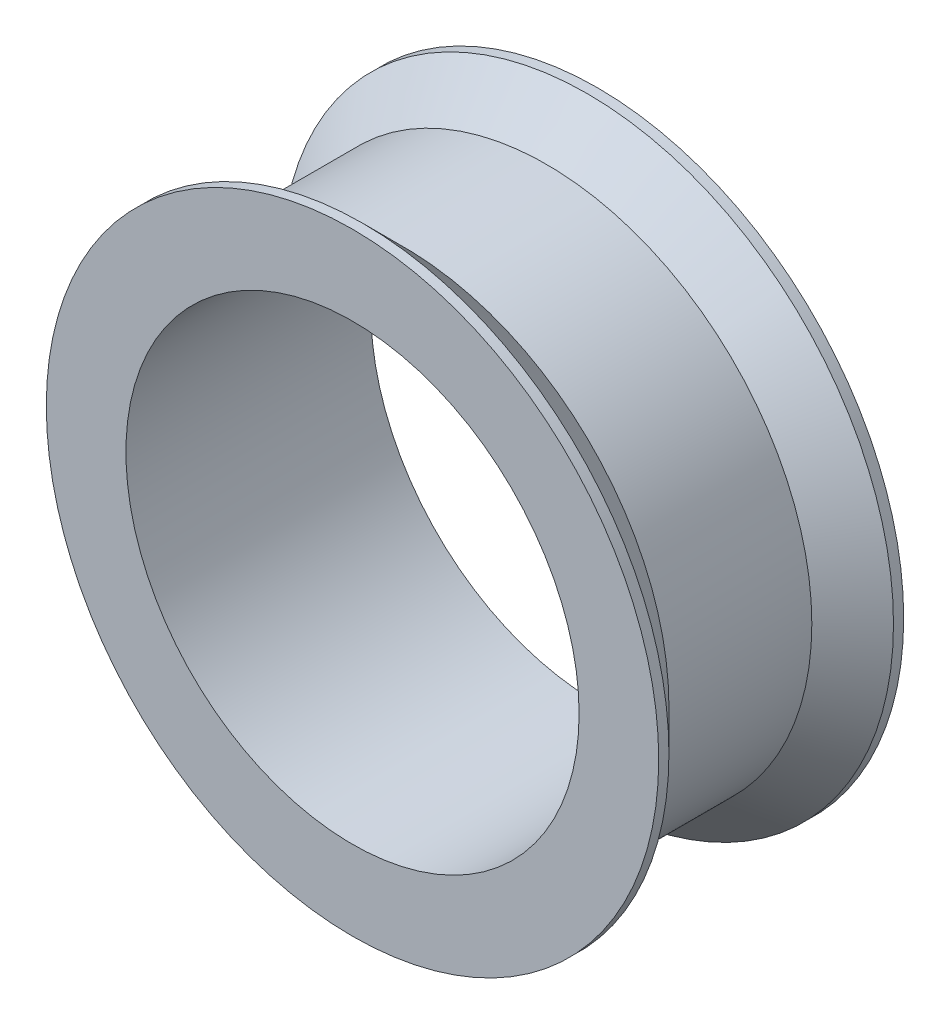
ISO-10303-21;
HEADER;
FILE_DESCRIPTION(('STEP AP214'),'2;1');
FILE_NAME('part.step','',(''),(''),'','','');
FILE_SCHEMA(('AUTOMOTIVE_DESIGN { 1 0 10303 214 1 1 1 1 }'));
ENDSEC;
DATA;
#1=APPLICATION_CONTEXT('core data for automotive mechanical design processes');
#2=APPLICATION_PROTOCOL_DEFINITION('international standard','automotive_design',2000,#1);
#3=PRODUCT_CONTEXT('',#1,'mechanical');
#4=PRODUCT('Part','Part','',(#3));
#5=PRODUCT_RELATED_PRODUCT_CATEGORY('part','',(#4));
#6=PRODUCT_DEFINITION_FORMATION('','',#4);
#7=PRODUCT_DEFINITION_CONTEXT('part definition',#1,'design');
#8=PRODUCT_DEFINITION('design','',#6,#7);
#9=PRODUCT_DEFINITION_SHAPE('','',#8);
#10=(LENGTH_UNIT() NAMED_UNIT(*) SI_UNIT(.MILLI.,.METRE.));
#11=(NAMED_UNIT(*) PLANE_ANGLE_UNIT() SI_UNIT($,.RADIAN.));
#12=(NAMED_UNIT(*) SI_UNIT($,.STERADIAN.) SOLID_ANGLE_UNIT());
#13=UNCERTAINTY_MEASURE_WITH_UNIT(LENGTH_MEASURE(1.E-05),#10,'distance_accuracy_value','');
#14=(GEOMETRIC_REPRESENTATION_CONTEXT(3) GLOBAL_UNCERTAINTY_ASSIGNED_CONTEXT((#13)) GLOBAL_UNIT_ASSIGNED_CONTEXT((#10,
#11,#12)) REPRESENTATION_CONTEXT('',''));
#15=CARTESIAN_POINT('',(0.,0.,0.));
#16=DIRECTION('',(0.,0.,1.));
#17=DIRECTION('',(1.,0.,0.));
#18=AXIS2_PLACEMENT_3D('',#15,#16,#17);
#19=CARTESIAN_POINT('',(0.,0.,6.));
#20=DIRECTION('',(0.,0.,-1.));
#21=DIRECTION('',(-1.,0.,0.));
#22=AXIS2_PLACEMENT_3D('',#19,#20,#21);
#23=CYLINDRICAL_SURFACE('',#22,15.);
#24=CARTESIAN_POINT('',(0.,0.,-5.50000000000002));
#25=DIRECTION('',(0.,0.,1.));
#26=DIRECTION('',(1.,0.,0.));
#27=AXIS2_PLACEMENT_3D('',#24,#25,#26);
#28=CIRCLE('',#27,15.);
#29=CARTESIAN_POINT('',(15.,0.,-5.50000000000002));
#30=VERTEX_POINT('',#29);
#31=EDGE_CURVE('E10',#30,#30,#28,.F.);
#32=ORIENTED_EDGE('',*,*,#31,.T.);
#33=EDGE_LOOP('',(#32));
#34=FACE_BOUND('',#33,.T.);
#35=CARTESIAN_POINT('',(0.,0.,-6.));
#36=DIRECTION('',(0.,0.,1.));
#37=DIRECTION('',(1.,0.,0.));
#38=AXIS2_PLACEMENT_3D('',#35,#36,#37);
#39=CIRCLE('',#38,15.);
#40=CARTESIAN_POINT('',(15.,0.,-6.));
#41=VERTEX_POINT('',#40);
#42=EDGE_CURVE('E54',#41,#41,#39,.T.);
#43=ORIENTED_EDGE('',*,*,#42,.T.);
#44=EDGE_LOOP('',(#43));
#45=FACE_BOUND('',#44,.T.);
#46=ADVANCED_FACE('F35',(#34,#45),#23,.T.);
#47=CARTESIAN_POINT('',(0.,0.,6.));
#48=DIRECTION('',(0.,0.,-1.));
#49=DIRECTION('',(-1.,0.,0.));
#50=AXIS2_PLACEMENT_3D('',#47,#48,#49);
#51=CYLINDRICAL_SURFACE('',#50,11.1);
#52=CARTESIAN_POINT('',(0.,0.,6.));
#53=DIRECTION('',(0.,0.,1.));
#54=DIRECTION('',(1.,0.,0.));
#55=AXIS2_PLACEMENT_3D('',#52,#53,#54);
#56=CIRCLE('',#55,11.1);
#57=CARTESIAN_POINT('',(11.1,0.,6.));
#58=VERTEX_POINT('',#57);
#59=EDGE_CURVE('E51',#58,#58,#56,.T.);
#60=ORIENTED_EDGE('',*,*,#59,.T.);
#61=EDGE_LOOP('',(#60));
#62=FACE_BOUND('',#61,.T.);
#63=CARTESIAN_POINT('',(0.,0.,-6.));
#64=DIRECTION('',(0.,0.,1.));
#65=DIRECTION('',(1.,0.,0.));
#66=AXIS2_PLACEMENT_3D('',#63,#64,#65);
#67=CIRCLE('',#66,11.1);
#68=CARTESIAN_POINT('',(11.1,0.,-6.));
#69=VERTEX_POINT('',#68);
#70=EDGE_CURVE('E57',#69,#69,#67,.T.);
#71=ORIENTED_EDGE('',*,*,#70,.F.);
#72=EDGE_LOOP('',(#71));
#73=FACE_BOUND('',#72,.T.);
#74=ADVANCED_FACE('F80',(#62,#73),#51,.F.);
#75=CARTESIAN_POINT('',(0.,0.,5.5));
#76=DIRECTION('',(0.,0.,1.));
#77=DIRECTION('',(1.,0.,0.));
#78=AXIS2_PLACEMENT_3D('',#75,#76,#77);
#79=CIRCLE('',#78,15.);
#80=CARTESIAN_POINT('',(15.,0.,5.5));
#81=VERTEX_POINT('',#80);
#82=EDGE_CURVE('E43',#81,#81,#79,.T.);
#83=ORIENTED_EDGE('',*,*,#82,.T.);
#84=EDGE_LOOP('',(#83));
#85=FACE_BOUND('',#84,.T.);
#86=CARTESIAN_POINT('',(0.,0.,6.));
#87=DIRECTION('',(0.,0.,1.));
#88=DIRECTION('',(1.,0.,0.));
#89=AXIS2_PLACEMENT_3D('',#86,#87,#88);
#90=CIRCLE('',#89,15.);
#91=CARTESIAN_POINT('',(15.,0.,6.));
#92=VERTEX_POINT('',#91);
#93=EDGE_CURVE('E47',#92,#92,#90,.T.);
#94=ORIENTED_EDGE('',*,*,#93,.F.);
#95=EDGE_LOOP('',(#94));
#96=FACE_BOUND('',#95,.T.);
#97=ADVANCED_FACE('F82',(#85,#96),#23,.T.);
#98=CARTESIAN_POINT('',(0.,0.,6.));
#99=DIRECTION('',(0.,0.,1.));
#100=DIRECTION('',(1.,0.,0.));
#101=AXIS2_PLACEMENT_3D('',#98,#99,#100);
#102=PLANE('',#101);
#103=ORIENTED_EDGE('',*,*,#59,.F.);
#104=EDGE_LOOP('',(#103));
#105=FACE_BOUND('',#104,.T.);
#106=ORIENTED_EDGE('',*,*,#93,.T.);
#107=EDGE_LOOP('',(#106));
#108=FACE_BOUND('',#107,.T.);
#109=ADVANCED_FACE('F91',(#105,#108),#102,.T.);
#110=CARTESIAN_POINT('',(0.,0.,-6.));
#111=DIRECTION('',(0.,0.,1.));
#112=DIRECTION('',(1.,0.,0.));
#113=AXIS2_PLACEMENT_3D('',#110,#111,#112);
#114=PLANE('',#113);
#115=ORIENTED_EDGE('',*,*,#70,.T.);
#116=EDGE_LOOP('',(#115));
#117=FACE_BOUND('',#116,.T.);
#118=ORIENTED_EDGE('',*,*,#42,.F.);
#119=EDGE_LOOP('',(#118));
#120=FACE_BOUND('',#119,.T.);
#121=ADVANCED_FACE('F95',(#117,#120),#114,.F.);
#122=CARTESIAN_POINT('',(0.,0.,-3.5));
#123=DIRECTION('',(0.,0.,1.));
#124=DIRECTION('',(1.,0.,0.));
#125=AXIS2_PLACEMENT_3D('',#122,#123,#124);
#126=CYLINDRICAL_SURFACE('',#125,13.);
#127=CARTESIAN_POINT('',(0.,0.,-3.5));
#128=DIRECTION('',(0.,0.,1.));
#129=DIRECTION('',(1.,0.,0.));
#130=AXIS2_PLACEMENT_3D('',#127,#128,#129);
#131=CIRCLE('',#130,13.);
#132=CARTESIAN_POINT('',(13.,0.,-3.5));
#133=VERTEX_POINT('',#132);
#134=EDGE_CURVE('E59',#133,#133,#131,.T.);
#135=ORIENTED_EDGE('',*,*,#134,.T.);
#136=EDGE_LOOP('',(#135));
#137=FACE_BOUND('',#136,.T.);
#138=CARTESIAN_POINT('',(0.,0.,3.5));
#139=DIRECTION('',(0.,0.,1.));
#140=DIRECTION('',(1.,0.,0.));
#141=AXIS2_PLACEMENT_3D('',#138,#139,#140);
#142=CIRCLE('',#141,13.);
#143=CARTESIAN_POINT('',(13.,0.,3.5));
#144=VERTEX_POINT('',#143);
#145=EDGE_CURVE('E63',#144,#144,#142,.T.);
#146=ORIENTED_EDGE('',*,*,#145,.F.);
#147=EDGE_LOOP('',(#146));
#148=FACE_BOUND('',#147,.T.);
#149=ADVANCED_FACE('F69',(#137,#148),#126,.T.);
#150=CARTESIAN_POINT('',(0.,0.,5.5));
#151=DIRECTION('',(0.,0.,1.));
#152=DIRECTION('',(1.,0.,0.));
#153=AXIS2_PLACEMENT_3D('',#150,#151,#152);
#154=CONICAL_SURFACE('',#153,15.,0.78539816339745);
#155=ORIENTED_EDGE('',*,*,#145,.T.);
#156=EDGE_LOOP('',(#155));
#157=FACE_BOUND('',#156,.T.);
#158=ORIENTED_EDGE('',*,*,#82,.F.);
#159=EDGE_LOOP('',(#158));
#160=FACE_BOUND('',#159,.T.);
#161=ADVANCED_FACE('F73',(#157,#160),#154,.T.);
#162=CARTESIAN_POINT('',(0.,0.,-3.5));
#163=DIRECTION('',(0.,0.,-1.));
#164=DIRECTION('',(-1.,0.,0.));
#165=AXIS2_PLACEMENT_3D('',#162,#163,#164);
#166=CONICAL_SURFACE('',#165,13.,0.785398163397446);
#167=ORIENTED_EDGE('',*,*,#31,.F.);
#168=EDGE_LOOP('',(#167));
#169=FACE_BOUND('',#168,.T.);
#170=ORIENTED_EDGE('',*,*,#134,.F.);
#171=EDGE_LOOP('',(#170));
#172=FACE_BOUND('',#171,.T.);
#173=ADVANCED_FACE('F38',(#169,#172),#166,.T.);
#174=CLOSED_SHELL('',(#46,#74,#97,#109,#121,#149,#161,#173));
#175=MANIFOLD_SOLID_BREP('B2',#174);
#176=ADVANCED_BREP_SHAPE_REPRESENTATION('',(#18,#175),#14);
#177=SHAPE_DEFINITION_REPRESENTATION(#9,#176);
ENDSEC;
END-ISO-10303-21;
